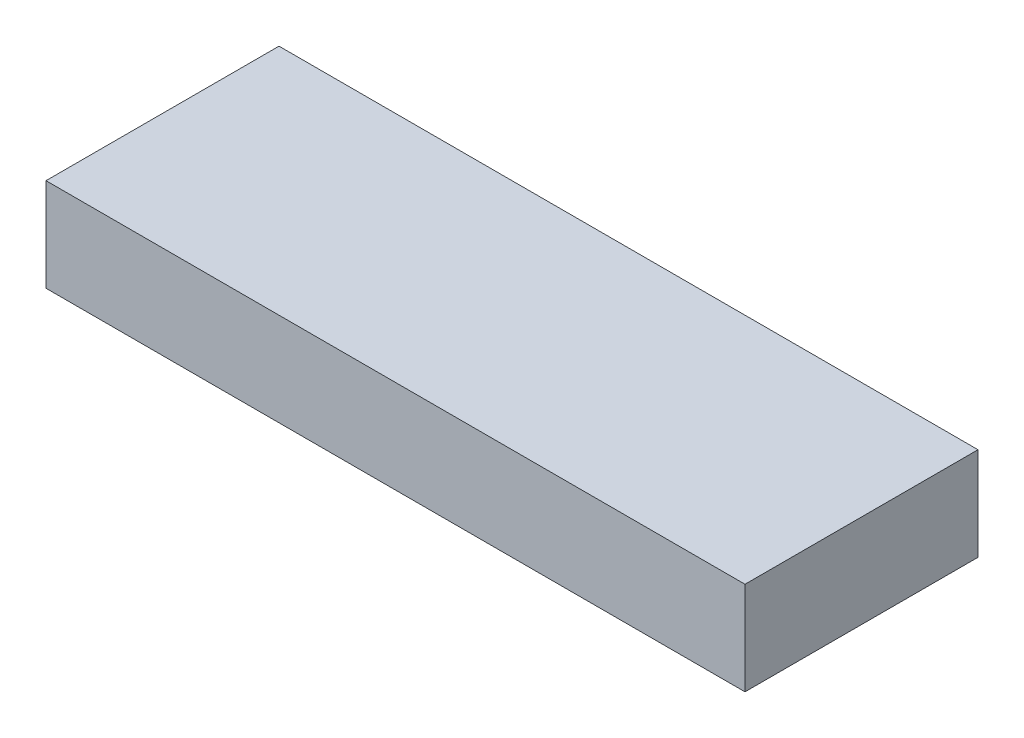
ISO-10303-21;
HEADER;
FILE_DESCRIPTION(('STEP AP214'),'2;1');
FILE_NAME('part.step','',(''),(''),'','','');
FILE_SCHEMA(('AUTOMOTIVE_DESIGN { 1 0 10303 214 1 1 1 1 }'));
ENDSEC;
DATA;
#1=APPLICATION_CONTEXT('core data for automotive mechanical design processes');
#2=APPLICATION_PROTOCOL_DEFINITION('international standard','automotive_design',2000,#1);
#3=PRODUCT_CONTEXT('',#1,'mechanical');
#4=PRODUCT('Part','Part','',(#3));
#5=PRODUCT_RELATED_PRODUCT_CATEGORY('part','',(#4));
#6=PRODUCT_DEFINITION_FORMATION('','',#4);
#7=PRODUCT_DEFINITION_CONTEXT('part definition',#1,'design');
#8=PRODUCT_DEFINITION('design','',#6,#7);
#9=PRODUCT_DEFINITION_SHAPE('','',#8);
#10=(LENGTH_UNIT() NAMED_UNIT(*) SI_UNIT(.MILLI.,.METRE.));
#11=(NAMED_UNIT(*) PLANE_ANGLE_UNIT() SI_UNIT($,.RADIAN.));
#12=(NAMED_UNIT(*) SI_UNIT($,.STERADIAN.) SOLID_ANGLE_UNIT());
#13=UNCERTAINTY_MEASURE_WITH_UNIT(LENGTH_MEASURE(1.E-05),#10,'distance_accuracy_value','');
#14=(GEOMETRIC_REPRESENTATION_CONTEXT(3) GLOBAL_UNCERTAINTY_ASSIGNED_CONTEXT((#13)) GLOBAL_UNIT_ASSIGNED_CONTEXT((#10,
#11,#12)) REPRESENTATION_CONTEXT('',''));
#15=CARTESIAN_POINT('',(0.,0.,0.));
#16=DIRECTION('',(0.,0.,1.));
#17=DIRECTION('',(1.,0.,0.));
#18=AXIS2_PLACEMENT_3D('',#15,#16,#17);
#19=CARTESIAN_POINT('',(-150.,20.,-50.));
#20=DIRECTION('',(1.,0.,0.));
#21=DIRECTION('',(0.,0.,-1.));
#22=AXIS2_PLACEMENT_3D('',#19,#20,#21);
#23=PLANE('',#22);
#24=DIRECTION('',(0.,0.,1.));
#25=VECTOR('',#24,1.);
#26=CARTESIAN_POINT('',(-150.,-20.,-50.));
#27=LINE('',#26,#25);
#28=CARTESIAN_POINT('',(-150.,-20.,-50.));
#29=VERTEX_POINT('',#28);
#30=CARTESIAN_POINT('',(-150.,-20.,50.));
#31=VERTEX_POINT('',#30);
#32=EDGE_CURVE('E98',#29,#31,#27,.T.);
#33=ORIENTED_EDGE('',*,*,#32,.T.);
#34=DIRECTION('',(0.,-1.,0.));
#35=VECTOR('',#34,1.);
#36=CARTESIAN_POINT('',(-150.,20.,50.));
#37=LINE('',#36,#35);
#38=CARTESIAN_POINT('',(-150.,20.,50.));
#39=VERTEX_POINT('',#38);
#40=EDGE_CURVE('E11',#39,#31,#37,.T.);
#41=ORIENTED_EDGE('',*,*,#40,.F.);
#42=DIRECTION('',(0.,0.,1.));
#43=VECTOR('',#42,1.);
#44=CARTESIAN_POINT('',(-150.,20.,-50.));
#45=LINE('',#44,#43);
#46=CARTESIAN_POINT('',(-150.,20.,-50.));
#47=VERTEX_POINT('',#46);
#48=EDGE_CURVE('E86',#47,#39,#45,.T.);
#49=ORIENTED_EDGE('',*,*,#48,.F.);
#50=DIRECTION('',(0.,-1.,0.));
#51=VECTOR('',#50,1.);
#52=CARTESIAN_POINT('',(-150.,20.,-50.));
#53=LINE('',#52,#51);
#54=EDGE_CURVE('E94',#47,#29,#53,.T.);
#55=ORIENTED_EDGE('',*,*,#54,.T.);
#56=EDGE_LOOP('',(#33,#41,#49,#55));
#57=FACE_BOUND('',#56,.T.);
#58=ADVANCED_FACE('F35',(#57),#23,.F.);
#59=CARTESIAN_POINT('',(-150.,20.,50.));
#60=DIRECTION('',(0.,0.,-1.));
#61=DIRECTION('',(-1.,0.,0.));
#62=AXIS2_PLACEMENT_3D('',#59,#60,#61);
#63=PLANE('',#62);
#64=DIRECTION('',(1.,0.,0.));
#65=VECTOR('',#64,1.);
#66=CARTESIAN_POINT('',(-150.,-20.,50.));
#67=LINE('',#66,#65);
#68=CARTESIAN_POINT('',(150.,-20.,50.));
#69=VERTEX_POINT('',#68);
#70=EDGE_CURVE('E90',#31,#69,#67,.T.);
#71=ORIENTED_EDGE('',*,*,#70,.T.);
#72=DIRECTION('',(0.,-1.,0.));
#73=VECTOR('',#72,1.);
#74=CARTESIAN_POINT('',(150.,20.,50.));
#75=LINE('',#74,#73);
#76=CARTESIAN_POINT('',(150.,20.,50.));
#77=VERTEX_POINT('',#76);
#78=EDGE_CURVE('E43',#77,#69,#75,.T.);
#79=ORIENTED_EDGE('',*,*,#78,.F.);
#80=DIRECTION('',(1.,0.,0.));
#81=VECTOR('',#80,1.);
#82=CARTESIAN_POINT('',(-150.,20.,50.));
#83=LINE('',#82,#81);
#84=EDGE_CURVE('E81',#39,#77,#83,.T.);
#85=ORIENTED_EDGE('',*,*,#84,.F.);
#86=ORIENTED_EDGE('',*,*,#40,.T.);
#87=EDGE_LOOP('',(#71,#79,#85,#86));
#88=FACE_BOUND('',#87,.T.);
#89=ADVANCED_FACE('F89',(#88),#63,.F.);
#90=CARTESIAN_POINT('',(150.,20.,-50.));
#91=DIRECTION('',(-1.,0.,0.));
#92=DIRECTION('',(0.,0.,1.));
#93=AXIS2_PLACEMENT_3D('',#90,#91,#92);
#94=PLANE('',#93);
#95=DIRECTION('',(0.,0.,-1.));
#96=VECTOR('',#95,1.);
#97=CARTESIAN_POINT('',(150.,-20.,-50.));
#98=LINE('',#97,#96);
#99=CARTESIAN_POINT('',(150.,-20.,-50.));
#100=VERTEX_POINT('',#99);
#101=EDGE_CURVE('E68',#69,#100,#98,.T.);
#102=ORIENTED_EDGE('',*,*,#101,.T.);
#103=DIRECTION('',(0.,-1.,0.));
#104=VECTOR('',#103,1.);
#105=CARTESIAN_POINT('',(150.,20.,-50.));
#106=LINE('',#105,#104);
#107=CARTESIAN_POINT('',(150.,20.,-50.));
#108=VERTEX_POINT('',#107);
#109=EDGE_CURVE('E91',#108,#100,#106,.T.);
#110=ORIENTED_EDGE('',*,*,#109,.F.);
#111=DIRECTION('',(0.,0.,-1.));
#112=VECTOR('',#111,1.);
#113=CARTESIAN_POINT('',(150.,20.,-50.));
#114=LINE('',#113,#112);
#115=EDGE_CURVE('E84',#77,#108,#114,.T.);
#116=ORIENTED_EDGE('',*,*,#115,.F.);
#117=ORIENTED_EDGE('',*,*,#78,.T.);
#118=EDGE_LOOP('',(#102,#110,#116,#117));
#119=FACE_BOUND('',#118,.T.);
#120=ADVANCED_FACE('F92',(#119),#94,.F.);
#121=CARTESIAN_POINT('',(-150.,20.,-50.));
#122=DIRECTION('',(0.,0.,1.));
#123=DIRECTION('',(1.,0.,0.));
#124=AXIS2_PLACEMENT_3D('',#121,#122,#123);
#125=PLANE('',#124);
#126=DIRECTION('',(-1.,0.,0.));
#127=VECTOR('',#126,1.);
#128=CARTESIAN_POINT('',(-150.,-20.,-50.));
#129=LINE('',#128,#127);
#130=EDGE_CURVE('E74',#100,#29,#129,.T.);
#131=ORIENTED_EDGE('',*,*,#130,.T.);
#132=ORIENTED_EDGE('',*,*,#54,.F.);
#133=DIRECTION('',(-1.,0.,0.));
#134=VECTOR('',#133,1.);
#135=CARTESIAN_POINT('',(-150.,20.,-50.));
#136=LINE('',#135,#134);
#137=EDGE_CURVE('E51',#108,#47,#136,.T.);
#138=ORIENTED_EDGE('',*,*,#137,.F.);
#139=ORIENTED_EDGE('',*,*,#109,.T.);
#140=EDGE_LOOP('',(#131,#132,#138,#139));
#141=FACE_BOUND('',#140,.T.);
#142=ADVANCED_FACE('F105',(#141),#125,.F.);
#143=CARTESIAN_POINT('',(0.,20.,0.));
#144=DIRECTION('',(0.,1.,0.));
#145=DIRECTION('',(0.,0.,1.));
#146=AXIS2_PLACEMENT_3D('',#143,#144,#145);
#147=PLANE('',#146);
#148=ORIENTED_EDGE('',*,*,#48,.T.);
#149=ORIENTED_EDGE('',*,*,#84,.T.);
#150=ORIENTED_EDGE('',*,*,#115,.T.);
#151=ORIENTED_EDGE('',*,*,#137,.T.);
#152=EDGE_LOOP('',(#148,#149,#150,#151));
#153=FACE_BOUND('',#152,.T.);
#154=ADVANCED_FACE('F82',(#153),#147,.T.);
#155=CARTESIAN_POINT('',(0.,-20.,0.));
#156=DIRECTION('',(0.,1.,0.));
#157=DIRECTION('',(0.,0.,1.));
#158=AXIS2_PLACEMENT_3D('',#155,#156,#157);
#159=PLANE('',#158);
#160=ORIENTED_EDGE('',*,*,#32,.F.);
#161=ORIENTED_EDGE('',*,*,#130,.F.);
#162=ORIENTED_EDGE('',*,*,#101,.F.);
#163=ORIENTED_EDGE('',*,*,#70,.F.);
#164=EDGE_LOOP('',(#160,#161,#162,#163));
#165=FACE_BOUND('',#164,.T.);
#166=ADVANCED_FACE('F108',(#165),#159,.F.);
#167=CLOSED_SHELL('',(#58,#89,#120,#142,#154,#166));
#168=MANIFOLD_SOLID_BREP('B2',#167);
#169=ADVANCED_BREP_SHAPE_REPRESENTATION('',(#18,#168),#14);
#170=SHAPE_DEFINITION_REPRESENTATION(#9,#169);
ENDSEC;
END-ISO-10303-21;
